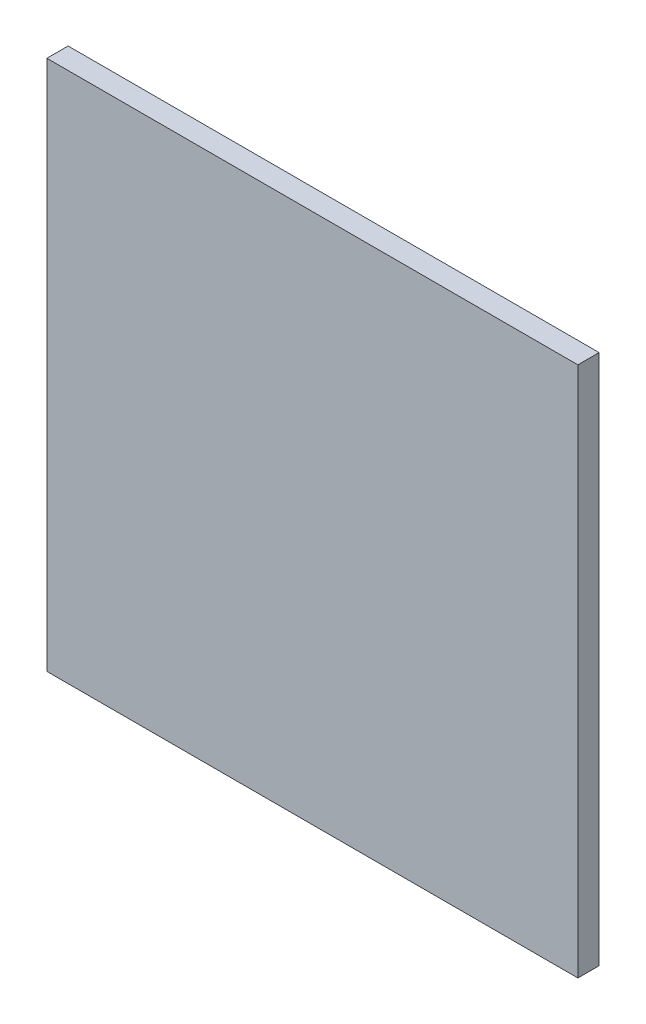
ISO-10303-21;
HEADER;
FILE_DESCRIPTION(('STEP AP214'),'2;1');
FILE_NAME('part.step','',(''),(''),'','','');
FILE_SCHEMA(('AUTOMOTIVE_DESIGN { 1 0 10303 214 1 1 1 1 }'));
ENDSEC;
DATA;
#1=APPLICATION_CONTEXT('core data for automotive mechanical design processes');
#2=APPLICATION_PROTOCOL_DEFINITION('international standard','automotive_design',2000,#1);
#3=PRODUCT_CONTEXT('',#1,'mechanical');
#4=PRODUCT('Part','Part','',(#3));
#5=PRODUCT_RELATED_PRODUCT_CATEGORY('part','',(#4));
#6=PRODUCT_DEFINITION_FORMATION('','',#4);
#7=PRODUCT_DEFINITION_CONTEXT('part definition',#1,'design');
#8=PRODUCT_DEFINITION('design','',#6,#7);
#9=PRODUCT_DEFINITION_SHAPE('','',#8);
#10=(LENGTH_UNIT() NAMED_UNIT(*) SI_UNIT(.MILLI.,.METRE.));
#11=(NAMED_UNIT(*) PLANE_ANGLE_UNIT() SI_UNIT($,.RADIAN.));
#12=(NAMED_UNIT(*) SI_UNIT($,.STERADIAN.) SOLID_ANGLE_UNIT());
#13=UNCERTAINTY_MEASURE_WITH_UNIT(LENGTH_MEASURE(1.E-05),#10,'distance_accuracy_value','');
#14=(GEOMETRIC_REPRESENTATION_CONTEXT(3) GLOBAL_UNCERTAINTY_ASSIGNED_CONTEXT((#13)) GLOBAL_UNIT_ASSIGNED_CONTEXT((#10,
#11,#12)) REPRESENTATION_CONTEXT('',''));
#15=CARTESIAN_POINT('',(0.,0.,0.));
#16=DIRECTION('',(0.,0.,1.));
#17=DIRECTION('',(1.,0.,0.));
#18=AXIS2_PLACEMENT_3D('',#15,#16,#17);
#19=CARTESIAN_POINT('',(128.994191701755,-135.612644671843,-3.));
#20=DIRECTION('',(0.,0.,-1.));
#21=DIRECTION('',(-1.,0.,0.));
#22=AXIS2_PLACEMENT_3D('',#19,#20,#21);
#23=PLANE('',#22);
#24=CARTESIAN_POINT('',(128.994191701755,-135.612644671843,-3.));
#25=DIRECTION('',(0.,0.,-1.));
#26=DIRECTION('',(-1.,0.,0.));
#27=AXIS2_PLACEMENT_3D('',#24,#25,#26);
#28=CIRCLE('',#27,1.5);
#29=CARTESIAN_POINT('',(127.494191701755,-135.612644671843,-3.));
#30=VERTEX_POINT('',#29);
#31=EDGE_CURVE('E11',#30,#30,#28,.T.);
#32=ORIENTED_EDGE('',*,*,#31,.T.);
#33=EDGE_LOOP('',(#32));
#34=FACE_BOUND('',#33,.T.);
#35=ADVANCED_FACE('F41',(#34),#23,.T.);
#36=CARTESIAN_POINT('',(128.994191701755,-135.612644671843,-3.));
#37=DIRECTION('',(0.,0.,1.));
#38=DIRECTION('',(-1.,0.,0.));
#39=AXIS2_PLACEMENT_3D('',#36,#37,#38);
#40=CONICAL_SURFACE('',#39,1.5,0.5235987755983);
#41=ORIENTED_EDGE('',*,*,#31,.F.);
#42=EDGE_LOOP('',(#41));
#43=FACE_BOUND('',#42,.T.);
#44=CARTESIAN_POINT('',(128.994191701755,-135.612644671843,0.));
#45=DIRECTION('',(0.,0.,1.));
#46=DIRECTION('',(1.,0.,0.));
#47=AXIS2_PLACEMENT_3D('',#44,#45,#46);
#48=CIRCLE('',#47,3.23205080756888);
#49=CARTESIAN_POINT('',(132.226242509324,-135.612644671843,0.));
#50=VERTEX_POINT('',#49);
#51=EDGE_CURVE('E45',#50,#50,#48,.F.);
#52=ORIENTED_EDGE('',*,*,#51,.T.);
#53=EDGE_LOOP('',(#52));
#54=FACE_BOUND('',#53,.T.);
#55=ADVANCED_FACE('F43',(#43,#54),#40,.T.);
#56=CARTESIAN_POINT('',(128.994191701755,-105.612644671843,-3.));
#57=DIRECTION('',(0.,0.,-1.));
#58=DIRECTION('',(-1.,0.,0.));
#59=AXIS2_PLACEMENT_3D('',#56,#57,#58);
#60=PLANE('',#59);
#61=CARTESIAN_POINT('',(128.994191701755,-105.612644671843,-3.));
#62=DIRECTION('',(0.,0.,-1.));
#63=DIRECTION('',(-1.,0.,0.));
#64=AXIS2_PLACEMENT_3D('',#61,#62,#63);
#65=CIRCLE('',#64,1.5);
#66=CARTESIAN_POINT('',(127.494191701755,-105.612644671843,-3.));
#67=VERTEX_POINT('',#66);
#68=EDGE_CURVE('E150',#67,#67,#65,.T.);
#69=ORIENTED_EDGE('',*,*,#68,.T.);
#70=EDGE_LOOP('',(#69));
#71=FACE_BOUND('',#70,.T.);
#72=ADVANCED_FACE('F183',(#71),#60,.T.);
#73=CARTESIAN_POINT('',(128.994191701755,-105.612644671843,-3.));
#74=DIRECTION('',(0.,0.,1.));
#75=DIRECTION('',(-1.,0.,0.));
#76=AXIS2_PLACEMENT_3D('',#73,#74,#75);
#77=CONICAL_SURFACE('',#76,1.5,0.5235987755983);
#78=ORIENTED_EDGE('',*,*,#68,.F.);
#79=EDGE_LOOP('',(#78));
#80=FACE_BOUND('',#79,.T.);
#81=CARTESIAN_POINT('',(128.994191701755,-105.612644671843,0.));
#82=DIRECTION('',(0.,0.,1.));
#83=DIRECTION('',(1.,0.,0.));
#84=AXIS2_PLACEMENT_3D('',#81,#82,#83);
#85=CIRCLE('',#84,3.23205080756888);
#86=CARTESIAN_POINT('',(132.226242509324,-105.612644671843,0.));
#87=VERTEX_POINT('',#86);
#88=EDGE_CURVE('E149',#87,#87,#85,.F.);
#89=ORIENTED_EDGE('',*,*,#88,.T.);
#90=EDGE_LOOP('',(#89));
#91=FACE_BOUND('',#90,.T.);
#92=ADVANCED_FACE('F170',(#80,#91),#77,.T.);
#93=CARTESIAN_POINT('',(128.994191701755,-75.6126446718427,-3.));
#94=DIRECTION('',(0.,0.,-1.));
#95=DIRECTION('',(-1.,0.,0.));
#96=AXIS2_PLACEMENT_3D('',#93,#94,#95);
#97=PLANE('',#96);
#98=CARTESIAN_POINT('',(128.994191701755,-75.6126446718427,-3.));
#99=DIRECTION('',(0.,0.,-1.));
#100=DIRECTION('',(-1.,0.,0.));
#101=AXIS2_PLACEMENT_3D('',#98,#99,#100);
#102=CIRCLE('',#101,1.5);
#103=CARTESIAN_POINT('',(127.494191701755,-75.6126446718427,-3.));
#104=VERTEX_POINT('',#103);
#105=EDGE_CURVE('E145',#104,#104,#102,.T.);
#106=ORIENTED_EDGE('',*,*,#105,.T.);
#107=EDGE_LOOP('',(#106));
#108=FACE_BOUND('',#107,.T.);
#109=ADVANCED_FACE('F218',(#108),#97,.T.);
#110=CARTESIAN_POINT('',(128.994191701755,-75.6126446718427,-3.));
#111=DIRECTION('',(0.,0.,1.));
#112=DIRECTION('',(-1.,0.,0.));
#113=AXIS2_PLACEMENT_3D('',#110,#111,#112);
#114=CONICAL_SURFACE('',#113,1.5,0.5235987755983);
#115=ORIENTED_EDGE('',*,*,#105,.F.);
#116=EDGE_LOOP('',(#115));
#117=FACE_BOUND('',#116,.T.);
#118=CARTESIAN_POINT('',(128.994191701755,-75.6126446718427,0.));
#119=DIRECTION('',(0.,0.,1.));
#120=DIRECTION('',(1.,0.,0.));
#121=AXIS2_PLACEMENT_3D('',#118,#119,#120);
#122=CIRCLE('',#121,3.23205080756888);
#123=CARTESIAN_POINT('',(132.226242509324,-75.6126446718427,0.));
#124=VERTEX_POINT('',#123);
#125=EDGE_CURVE('E143',#124,#124,#122,.F.);
#126=ORIENTED_EDGE('',*,*,#125,.T.);
#127=EDGE_LOOP('',(#126));
#128=FACE_BOUND('',#127,.T.);
#129=ADVANCED_FACE('F216',(#117,#128),#114,.T.);
#130=CARTESIAN_POINT('',(128.994191701755,-45.6126446718427,-3.));
#131=DIRECTION('',(0.,0.,-1.));
#132=DIRECTION('',(-1.,0.,0.));
#133=AXIS2_PLACEMENT_3D('',#130,#131,#132);
#134=PLANE('',#133);
#135=CARTESIAN_POINT('',(128.994191701755,-45.6126446718427,-3.));
#136=DIRECTION('',(0.,0.,-1.));
#137=DIRECTION('',(-1.,0.,0.));
#138=AXIS2_PLACEMENT_3D('',#135,#136,#137);
#139=CIRCLE('',#138,1.5);
#140=CARTESIAN_POINT('',(127.494191701755,-45.6126446718427,-3.));
#141=VERTEX_POINT('',#140);
#142=EDGE_CURVE('E139',#141,#141,#139,.T.);
#143=ORIENTED_EDGE('',*,*,#142,.T.);
#144=EDGE_LOOP('',(#143));
#145=FACE_BOUND('',#144,.T.);
#146=ADVANCED_FACE('F214',(#145),#134,.T.);
#147=CARTESIAN_POINT('',(128.994191701755,-45.6126446718427,-3.));
#148=DIRECTION('',(0.,0.,1.));
#149=DIRECTION('',(-1.,0.,0.));
#150=AXIS2_PLACEMENT_3D('',#147,#148,#149);
#151=CONICAL_SURFACE('',#150,1.5,0.5235987755983);
#152=ORIENTED_EDGE('',*,*,#142,.F.);
#153=EDGE_LOOP('',(#152));
#154=FACE_BOUND('',#153,.T.);
#155=CARTESIAN_POINT('',(128.994191701755,-45.6126446718427,0.));
#156=DIRECTION('',(0.,0.,1.));
#157=DIRECTION('',(1.,0.,0.));
#158=AXIS2_PLACEMENT_3D('',#155,#156,#157);
#159=CIRCLE('',#158,3.23205080756888);
#160=CARTESIAN_POINT('',(132.226242509324,-45.6126446718427,0.));
#161=VERTEX_POINT('',#160);
#162=EDGE_CURVE('E144',#161,#161,#159,.F.);
#163=ORIENTED_EDGE('',*,*,#162,.T.);
#164=EDGE_LOOP('',(#163));
#165=FACE_BOUND('',#164,.T.);
#166=ADVANCED_FACE('F210',(#154,#165),#151,.T.);
#167=CARTESIAN_POINT('',(-108.273056057866,75.9493670886076,10.));
#168=DIRECTION('',(1.,0.,0.));
#169=DIRECTION('',(0.,1.,0.));
#170=AXIS2_PLACEMENT_3D('',#167,#168,#169);
#171=PLANE('',#170);
#172=DIRECTION('',(0.,-1.,0.));
#173=VECTOR('',#172,1.);
#174=CARTESIAN_POINT('',(-108.273056057866,75.9493670886076,0.));
#175=LINE('',#174,#173);
#176=CARTESIAN_POINT('',(-108.273056057866,75.9493670886076,0.));
#177=VERTEX_POINT('',#176);
#178=CARTESIAN_POINT('',(-108.273056057866,-174.050632911392,0.));
#179=VERTEX_POINT('',#178);
#180=EDGE_CURVE('E115',#177,#179,#175,.T.);
#181=ORIENTED_EDGE('',*,*,#180,.T.);
#182=DIRECTION('',(0.,0.,-1.));
#183=VECTOR('',#182,1.);
#184=CARTESIAN_POINT('',(-108.273056057866,-174.050632911392,10.));
#185=LINE('',#184,#183);
#186=CARTESIAN_POINT('',(-108.273056057866,-174.050632911392,10.));
#187=VERTEX_POINT('',#186);
#188=EDGE_CURVE('E105',#187,#179,#185,.T.);
#189=ORIENTED_EDGE('',*,*,#188,.F.);
#190=DIRECTION('',(0.,-1.,0.));
#191=VECTOR('',#190,1.);
#192=CARTESIAN_POINT('',(-108.273056057866,75.9493670886076,10.));
#193=LINE('',#192,#191);
#194=CARTESIAN_POINT('',(-108.273056057866,75.9493670886076,10.));
#195=VERTEX_POINT('',#194);
#196=EDGE_CURVE('E94',#195,#187,#193,.T.);
#197=ORIENTED_EDGE('',*,*,#196,.F.);
#198=DIRECTION('',(0.,0.,-1.));
#199=VECTOR('',#198,1.);
#200=CARTESIAN_POINT('',(-108.273056057866,75.9493670886076,10.));
#201=LINE('',#200,#199);
#202=EDGE_CURVE('E60',#195,#177,#201,.T.);
#203=ORIENTED_EDGE('',*,*,#202,.T.);
#204=EDGE_LOOP('',(#181,#189,#197,#203));
#205=FACE_BOUND('',#204,.T.);
#206=ADVANCED_FACE('F213',(#205),#171,.F.);
#207=CARTESIAN_POINT('',(-108.273056057866,-174.050632911392,10.));
#208=DIRECTION('',(0.,1.,0.));
#209=DIRECTION('',(0.,0.,1.));
#210=AXIS2_PLACEMENT_3D('',#207,#208,#209);
#211=PLANE('',#210);
#212=DIRECTION('',(1.,0.,0.));
#213=VECTOR('',#212,1.);
#214=CARTESIAN_POINT('',(-108.273056057866,-174.050632911392,0.));
#215=LINE('',#214,#213);
#216=CARTESIAN_POINT('',(141.726943942134,-174.050632911392,0.));
#217=VERTEX_POINT('',#216);
#218=EDGE_CURVE('E101',#179,#217,#215,.T.);
#219=ORIENTED_EDGE('',*,*,#218,.T.);
#220=DIRECTION('',(0.,0.,-1.));
#221=VECTOR('',#220,1.);
#222=CARTESIAN_POINT('',(141.726943942134,-174.050632911392,10.));
#223=LINE('',#222,#221);
#224=CARTESIAN_POINT('',(141.726943942134,-174.050632911392,10.));
#225=VERTEX_POINT('',#224);
#226=EDGE_CURVE('E99',#225,#217,#223,.T.);
#227=ORIENTED_EDGE('',*,*,#226,.F.);
#228=DIRECTION('',(1.,0.,0.));
#229=VECTOR('',#228,1.);
#230=CARTESIAN_POINT('',(-108.273056057866,-174.050632911392,10.));
#231=LINE('',#230,#229);
#232=EDGE_CURVE('E86',#187,#225,#231,.T.);
#233=ORIENTED_EDGE('',*,*,#232,.F.);
#234=ORIENTED_EDGE('',*,*,#188,.T.);
#235=EDGE_LOOP('',(#219,#227,#233,#234));
#236=FACE_BOUND('',#235,.T.);
#237=ADVANCED_FACE('F100',(#236),#211,.F.);
#238=CARTESIAN_POINT('',(141.726943942134,75.9493670886076,10.));
#239=DIRECTION('',(1.,0.,0.));
#240=DIRECTION('',(0.,1.,0.));
#241=AXIS2_PLACEMENT_3D('',#238,#239,#240);
#242=PLANE('',#241);
#243=DIRECTION('',(0.,-1.,0.));
#244=VECTOR('',#243,1.);
#245=CARTESIAN_POINT('',(141.726943942134,75.9493670886076,0.));
#246=LINE('',#245,#244);
#247=CARTESIAN_POINT('',(141.726943942134,75.9493670886076,0.));
#248=VERTEX_POINT('',#247);
#249=EDGE_CURVE('E121',#248,#217,#246,.T.);
#250=ORIENTED_EDGE('',*,*,#249,.F.);
#251=DIRECTION('',(0.,0.,-1.));
#252=VECTOR('',#251,1.);
#253=CARTESIAN_POINT('',(141.726943942134,75.9493670886076,10.));
#254=LINE('',#253,#252);
#255=CARTESIAN_POINT('',(141.726943942134,75.9493670886076,10.));
#256=VERTEX_POINT('',#255);
#257=EDGE_CURVE('E74',#256,#248,#254,.T.);
#258=ORIENTED_EDGE('',*,*,#257,.F.);
#259=DIRECTION('',(0.,-1.,0.));
#260=VECTOR('',#259,1.);
#261=CARTESIAN_POINT('',(141.726943942134,75.9493670886076,10.));
#262=LINE('',#261,#260);
#263=EDGE_CURVE('E93',#256,#225,#262,.T.);
#264=ORIENTED_EDGE('',*,*,#263,.T.);
#265=ORIENTED_EDGE('',*,*,#226,.T.);
#266=EDGE_LOOP('',(#250,#258,#264,#265));
#267=FACE_BOUND('',#266,.T.);
#268=ADVANCED_FACE('F107',(#267),#242,.T.);
#269=CARTESIAN_POINT('',(-108.273056057866,75.9493670886076,10.));
#270=DIRECTION('',(0.,1.,0.));
#271=DIRECTION('',(0.,0.,1.));
#272=AXIS2_PLACEMENT_3D('',#269,#270,#271);
#273=PLANE('',#272);
#274=DIRECTION('',(1.,0.,0.));
#275=VECTOR('',#274,1.);
#276=CARTESIAN_POINT('',(-108.273056057866,75.9493670886076,0.));
#277=LINE('',#276,#275);
#278=EDGE_CURVE('E124',#177,#248,#277,.T.);
#279=ORIENTED_EDGE('',*,*,#278,.F.);
#280=ORIENTED_EDGE('',*,*,#202,.F.);
#281=DIRECTION('',(1.,0.,0.));
#282=VECTOR('',#281,1.);
#283=CARTESIAN_POINT('',(-108.273056057866,75.9493670886076,10.));
#284=LINE('',#283,#282);
#285=EDGE_CURVE('E109',#195,#256,#284,.T.);
#286=ORIENTED_EDGE('',*,*,#285,.T.);
#287=ORIENTED_EDGE('',*,*,#257,.T.);
#288=EDGE_LOOP('',(#279,#280,#286,#287));
#289=FACE_BOUND('',#288,.T.);
#290=ADVANCED_FACE('F239',(#289),#273,.T.);
#291=CARTESIAN_POINT('',(0.,0.,10.));
#292=DIRECTION('',(0.,0.,1.));
#293=DIRECTION('',(1.,0.,0.));
#294=AXIS2_PLACEMENT_3D('',#291,#292,#293);
#295=PLANE('',#294);
#296=ORIENTED_EDGE('',*,*,#196,.T.);
#297=ORIENTED_EDGE('',*,*,#232,.T.);
#298=ORIENTED_EDGE('',*,*,#263,.F.);
#299=ORIENTED_EDGE('',*,*,#285,.F.);
#300=EDGE_LOOP('',(#296,#297,#298,#299));
#301=FACE_BOUND('',#300,.T.);
#302=ADVANCED_FACE('F90',(#301),#295,.T.);
#303=CARTESIAN_POINT('',(0.,0.,0.));
#304=DIRECTION('',(0.,0.,1.));
#305=DIRECTION('',(1.,0.,0.));
#306=AXIS2_PLACEMENT_3D('',#303,#304,#305);
#307=PLANE('',#306);
#308=CARTESIAN_POINT('',(128.994191701755,-15.6126446718427,0.));
#309=DIRECTION('',(0.,0.,1.));
#310=DIRECTION('',(1.,0.,0.));
#311=AXIS2_PLACEMENT_3D('',#308,#309,#310);
#312=CIRCLE('',#311,3.23205080756888);
#313=CARTESIAN_POINT('',(132.226242509324,-15.6126446718427,0.));
#314=VERTEX_POINT('',#313);
#315=EDGE_CURVE('E157',#314,#314,#312,.F.);
#316=ORIENTED_EDGE('',*,*,#315,.F.);
#317=EDGE_LOOP('',(#316));
#318=FACE_BOUND('',#317,.T.);
#319=CARTESIAN_POINT('',(128.994191701755,14.3873553281573,0.));
#320=DIRECTION('',(0.,0.,1.));
#321=DIRECTION('',(1.,0.,0.));
#322=AXIS2_PLACEMENT_3D('',#319,#320,#321);
#323=CIRCLE('',#322,3.23205080756888);
#324=CARTESIAN_POINT('',(132.226242509324,14.3873553281573,0.));
#325=VERTEX_POINT('',#324);
#326=EDGE_CURVE('E138',#325,#325,#323,.F.);
#327=ORIENTED_EDGE('',*,*,#326,.F.);
#328=EDGE_LOOP('',(#327));
#329=FACE_BOUND('',#328,.T.);
#330=CARTESIAN_POINT('',(24.4793582532088,-68.7941565197944,0.));
#331=DIRECTION('',(0.,0.,1.));
#332=DIRECTION('',(1.,0.,0.));
#333=AXIS2_PLACEMENT_3D('',#330,#331,#332);
#334=CIRCLE('',#333,8.);
#335=CARTESIAN_POINT('',(32.4793582532088,-68.7941565197944,0.));
#336=VERTEX_POINT('',#335);
#337=EDGE_CURVE('E134',#336,#336,#334,.F.);
#338=ORIENTED_EDGE('',*,*,#337,.F.);
#339=EDGE_LOOP('',(#338));
#340=FACE_BOUND('',#339,.T.);
#341=ORIENTED_EDGE('',*,*,#180,.F.);
#342=ORIENTED_EDGE('',*,*,#278,.T.);
#343=ORIENTED_EDGE('',*,*,#249,.T.);
#344=ORIENTED_EDGE('',*,*,#218,.F.);
#345=EDGE_LOOP('',(#341,#342,#343,#344));
#346=FACE_BOUND('',#345,.T.);
#347=ORIENTED_EDGE('',*,*,#162,.F.);
#348=EDGE_LOOP('',(#347));
#349=FACE_BOUND('',#348,.T.);
#350=ORIENTED_EDGE('',*,*,#125,.F.);
#351=EDGE_LOOP('',(#350));
#352=FACE_BOUND('',#351,.T.);
#353=ORIENTED_EDGE('',*,*,#88,.F.);
#354=EDGE_LOOP('',(#353));
#355=FACE_BOUND('',#354,.T.);
#356=ORIENTED_EDGE('',*,*,#51,.F.);
#357=EDGE_LOOP('',(#356));
#358=FACE_BOUND('',#357,.T.);
#359=ADVANCED_FACE('F172',(#318,#329,#340,#346,#349,#352,#355,#358),#307,.F.);
#360=CARTESIAN_POINT('',(24.4793582532088,-68.7941565197944,-4.));
#361=DIRECTION('',(0.,0.,1.));
#362=DIRECTION('',(1.,0.,0.));
#363=AXIS2_PLACEMENT_3D('',#360,#361,#362);
#364=CYLINDRICAL_SURFACE('',#363,8.);
#365=CARTESIAN_POINT('',(24.4793582532088,-68.7941565197944,-4.));
#366=DIRECTION('',(0.,0.,-1.));
#367=DIRECTION('',(-1.,0.,0.));
#368=AXIS2_PLACEMENT_3D('',#365,#366,#367);
#369=CIRCLE('',#368,8.);
#370=CARTESIAN_POINT('',(16.4793582532088,-68.7941565197944,-4.));
#371=VERTEX_POINT('',#370);
#372=EDGE_CURVE('E118',#371,#371,#369,.T.);
#373=ORIENTED_EDGE('',*,*,#372,.F.);
#374=EDGE_LOOP('',(#373));
#375=FACE_BOUND('',#374,.T.);
#376=ORIENTED_EDGE('',*,*,#337,.T.);
#377=EDGE_LOOP('',(#376));
#378=FACE_BOUND('',#377,.T.);
#379=ADVANCED_FACE('F175',(#375,#378),#364,.T.);
#380=CARTESIAN_POINT('',(24.4793582532088,-68.7941565197944,-4.));
#381=DIRECTION('',(0.,0.,-1.));
#382=DIRECTION('',(-1.,0.,0.));
#383=AXIS2_PLACEMENT_3D('',#380,#381,#382);
#384=PLANE('',#383);
#385=ORIENTED_EDGE('',*,*,#372,.T.);
#386=EDGE_LOOP('',(#385));
#387=FACE_BOUND('',#386,.T.);
#388=ADVANCED_FACE('F203',(#387),#384,.T.);
#389=CARTESIAN_POINT('',(128.994191701755,14.3873553281573,-3.));
#390=DIRECTION('',(0.,0.,1.));
#391=DIRECTION('',(-1.,0.,0.));
#392=AXIS2_PLACEMENT_3D('',#389,#390,#391);
#393=CONICAL_SURFACE('',#392,1.5,0.5235987755983);
#394=CARTESIAN_POINT('',(128.994191701755,14.3873553281573,-3.));
#395=DIRECTION('',(0.,0.,-1.));
#396=DIRECTION('',(-1.,0.,0.));
#397=AXIS2_PLACEMENT_3D('',#394,#395,#396);
#398=CIRCLE('',#397,1.5);
#399=CARTESIAN_POINT('',(127.494191701755,14.3873553281573,-3.));
#400=VERTEX_POINT('',#399);
#401=EDGE_CURVE('E260',#400,#400,#398,.T.);
#402=ORIENTED_EDGE('',*,*,#401,.F.);
#403=EDGE_LOOP('',(#402));
#404=FACE_BOUND('',#403,.T.);
#405=ORIENTED_EDGE('',*,*,#326,.T.);
#406=EDGE_LOOP('',(#405));
#407=FACE_BOUND('',#406,.T.);
#408=ADVANCED_FACE('F199',(#404,#407),#393,.T.);
#409=CARTESIAN_POINT('',(128.994191701755,14.3873553281573,-3.));
#410=DIRECTION('',(0.,0.,-1.));
#411=DIRECTION('',(-1.,0.,0.));
#412=AXIS2_PLACEMENT_3D('',#409,#410,#411);
#413=PLANE('',#412);
#414=ORIENTED_EDGE('',*,*,#401,.T.);
#415=EDGE_LOOP('',(#414));
#416=FACE_BOUND('',#415,.T.);
#417=ADVANCED_FACE('F202',(#416),#413,.T.);
#418=CARTESIAN_POINT('',(128.994191701755,-15.6126446718427,-3.));
#419=DIRECTION('',(0.,0.,1.));
#420=DIRECTION('',(-1.,0.,0.));
#421=AXIS2_PLACEMENT_3D('',#418,#419,#420);
#422=CONICAL_SURFACE('',#421,1.5,0.5235987755983);
#423=CARTESIAN_POINT('',(128.994191701755,-15.6126446718427,-3.));
#424=DIRECTION('',(0.,0.,-1.));
#425=DIRECTION('',(-1.,0.,0.));
#426=AXIS2_PLACEMENT_3D('',#423,#424,#425);
#427=CIRCLE('',#426,1.5);
#428=CARTESIAN_POINT('',(127.494191701755,-15.6126446718427,-3.));
#429=VERTEX_POINT('',#428);
#430=EDGE_CURVE('E258',#429,#429,#427,.T.);
#431=ORIENTED_EDGE('',*,*,#430,.F.);
#432=EDGE_LOOP('',(#431));
#433=FACE_BOUND('',#432,.T.);
#434=ORIENTED_EDGE('',*,*,#315,.T.);
#435=EDGE_LOOP('',(#434));
#436=FACE_BOUND('',#435,.T.);
#437=ADVANCED_FACE('F205',(#433,#436),#422,.T.);
#438=CARTESIAN_POINT('',(128.994191701755,-15.6126446718427,-3.));
#439=DIRECTION('',(0.,0.,-1.));
#440=DIRECTION('',(-1.,0.,0.));
#441=AXIS2_PLACEMENT_3D('',#438,#439,#440);
#442=PLANE('',#441);
#443=ORIENTED_EDGE('',*,*,#430,.T.);
#444=EDGE_LOOP('',(#443));
#445=FACE_BOUND('',#444,.T.);
#446=ADVANCED_FACE('F208',(#445),#442,.T.);
#447=CLOSED_SHELL('',(#35,#55,#72,#92,#109,#129,#146,#166,#206,#237,#268,#290,#302,#359,#379,
#388,#408,#417,#437,#446));
#448=MANIFOLD_SOLID_BREP('B2',#447);
#449=ADVANCED_BREP_SHAPE_REPRESENTATION('',(#18,#448),#14);
#450=SHAPE_DEFINITION_REPRESENTATION(#9,#449);
ENDSEC;
END-ISO-10303-21;
